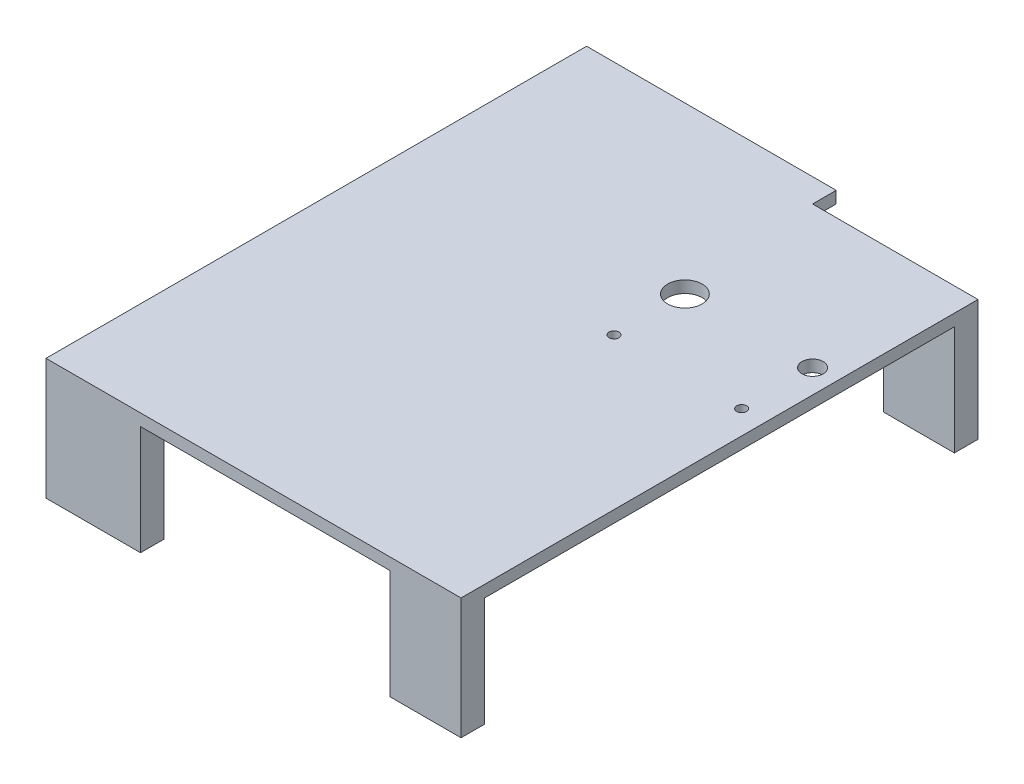
ISO-10303-21;
HEADER;
FILE_DESCRIPTION(('STEP AP214'),'2;1');
FILE_NAME('part.step','',(''),(''),'','','');
FILE_SCHEMA(('AUTOMOTIVE_DESIGN { 1 0 10303 214 1 1 1 1 }'));
ENDSEC;
DATA;
#1=APPLICATION_CONTEXT('core data for automotive mechanical design processes');
#2=APPLICATION_PROTOCOL_DEFINITION('international standard','automotive_design',2000,#1);
#3=PRODUCT_CONTEXT('',#1,'mechanical');
#4=PRODUCT('Part','Part','',(#3));
#5=PRODUCT_RELATED_PRODUCT_CATEGORY('part','',(#4));
#6=PRODUCT_DEFINITION_FORMATION('','',#4);
#7=PRODUCT_DEFINITION_CONTEXT('part definition',#1,'design');
#8=PRODUCT_DEFINITION('design','',#6,#7);
#9=PRODUCT_DEFINITION_SHAPE('','',#8);
#10=(LENGTH_UNIT() NAMED_UNIT(*) SI_UNIT(.MILLI.,.METRE.));
#11=(NAMED_UNIT(*) PLANE_ANGLE_UNIT() SI_UNIT($,.RADIAN.));
#12=(NAMED_UNIT(*) SI_UNIT($,.STERADIAN.) SOLID_ANGLE_UNIT());
#13=UNCERTAINTY_MEASURE_WITH_UNIT(LENGTH_MEASURE(1.E-05),#10,'distance_accuracy_value','');
#14=(GEOMETRIC_REPRESENTATION_CONTEXT(3) GLOBAL_UNCERTAINTY_ASSIGNED_CONTEXT((#13)) GLOBAL_UNIT_ASSIGNED_CONTEXT((#10,
#11,#12)) REPRESENTATION_CONTEXT('',''));
#15=CARTESIAN_POINT('',(0.,0.,0.));
#16=DIRECTION('',(0.,0.,1.));
#17=DIRECTION('',(1.,0.,0.));
#18=AXIS2_PLACEMENT_3D('',#15,#16,#17);
#19=CARTESIAN_POINT('',(12.7,0.,0.));
#20=DIRECTION('',(1.,0.,0.));
#21=DIRECTION('',(0.,0.,-1.));
#22=AXIS2_PLACEMENT_3D('',#19,#20,#21);
#23=PLANE('',#22);
#24=DIRECTION('',(0.,0.,-1.));
#25=VECTOR('',#24,1.);
#26=CARTESIAN_POINT('',(12.7,-58.7375,0.));
#27=LINE('',#26,#25);
#28=CARTESIAN_POINT('',(12.7,-58.7375,145.25625));
#29=VERTEX_POINT('',#28);
#30=CARTESIAN_POINT('',(12.7,-58.7375,132.55625));
#31=VERTEX_POINT('',#30);
#32=EDGE_CURVE('E144',#29,#31,#27,.T.);
#33=ORIENTED_EDGE('',*,*,#32,.T.);
#34=DIRECTION('',(0.,1.,0.));
#35=VECTOR('',#34,1.);
#36=CARTESIAN_POINT('',(12.7,-58.7375,132.55625));
#37=LINE('',#36,#35);
#38=CARTESIAN_POINT('',(12.7,0.,132.55625));
#39=VERTEX_POINT('',#38);
#40=EDGE_CURVE('E141',#31,#39,#37,.T.);
#41=ORIENTED_EDGE('',*,*,#40,.T.);
#42=DIRECTION('',(0.,0.,1.));
#43=VECTOR('',#42,1.);
#44=CARTESIAN_POINT('',(12.7,0.,0.));
#45=LINE('',#44,#43);
#46=CARTESIAN_POINT('',(12.7,0.,-119.85625));
#47=VERTEX_POINT('',#46);
#48=EDGE_CURVE('E128',#47,#39,#45,.T.);
#49=ORIENTED_EDGE('',*,*,#48,.F.);
#50=DIRECTION('',(0.,-1.,0.));
#51=VECTOR('',#50,1.);
#52=CARTESIAN_POINT('',(12.7,-58.7375,-119.85625));
#53=LINE('',#52,#51);
#54=CARTESIAN_POINT('',(12.7,-58.7375,-119.85625));
#55=VERTEX_POINT('',#54);
#56=EDGE_CURVE('E147',#47,#55,#53,.T.);
#57=ORIENTED_EDGE('',*,*,#56,.T.);
#58=DIRECTION('',(0.,0.,-1.));
#59=VECTOR('',#58,1.);
#60=CARTESIAN_POINT('',(12.7,-58.7375,0.));
#61=LINE('',#60,#59);
#62=CARTESIAN_POINT('',(12.7,-58.7375,-132.55625));
#63=VERTEX_POINT('',#62);
#64=EDGE_CURVE('E150',#55,#63,#61,.T.);
#65=ORIENTED_EDGE('',*,*,#64,.T.);
#66=DIRECTION('',(0.,1.,0.));
#67=VECTOR('',#66,1.);
#68=CARTESIAN_POINT('',(12.7,-10.16,-132.55625));
#69=LINE('',#68,#67);
#70=CARTESIAN_POINT('',(12.7,6.35,-132.55625));
#71=VERTEX_POINT('',#70);
#72=EDGE_CURVE('E138',#63,#71,#69,.T.);
#73=ORIENTED_EDGE('',*,*,#72,.T.);
#74=DIRECTION('',(0.,0.,1.));
#75=VECTOR('',#74,1.);
#76=CARTESIAN_POINT('',(12.7,6.35,0.));
#77=LINE('',#76,#75);
#78=CARTESIAN_POINT('',(12.7,6.35,145.25625));
#79=VERTEX_POINT('',#78);
#80=EDGE_CURVE('E135',#71,#79,#77,.T.);
#81=ORIENTED_EDGE('',*,*,#80,.T.);
#82=DIRECTION('',(0.,-1.,0.));
#83=VECTOR('',#82,1.);
#84=CARTESIAN_POINT('',(12.7,6.35,145.25625));
#85=LINE('',#84,#83);
#86=EDGE_CURVE('E132',#79,#29,#85,.T.);
#87=ORIENTED_EDGE('',*,*,#86,.T.);
#88=EDGE_LOOP('',(#33,#41,#49,#57,#65,#73,#81,#87));
#89=FACE_BOUND('',#88,.T.);
#90=ADVANCED_FACE('F33',(#89),#23,.T.);
#91=CARTESIAN_POINT('',(0.,0.,0.));
#92=DIRECTION('',(0.,-1.,0.));
#93=DIRECTION('',(0.,0.,-1.));
#94=AXIS2_PLACEMENT_3D('',#91,#92,#93);
#95=PLANE('',#94);
#96=CARTESIAN_POINT('',(-68.61175,0.,-56.35625));
#97=DIRECTION('',(0.,-1.,0.));
#98=DIRECTION('',(0.,0.,-1.));
#99=AXIS2_PLACEMENT_3D('',#96,#97,#98);
#100=CIRCLE('',#99,9.271);
#101=CARTESIAN_POINT('',(-68.61175,0.,-65.62725));
#102=VERTEX_POINT('',#101);
#103=EDGE_CURVE('E337',#102,#102,#100,.T.);
#104=ORIENTED_EDGE('',*,*,#103,.F.);
#105=EDGE_LOOP('',(#104));
#106=FACE_BOUND('',#105,.T.);
#107=CARTESIAN_POINT('',(0.,0.,-56.35625));
#108=DIRECTION('',(0.,-1.,0.));
#109=DIRECTION('',(0.,0.,-1.));
#110=AXIS2_PLACEMENT_3D('',#107,#108,#109);
#111=CIRCLE('',#110,5.71500000000001);
#112=CARTESIAN_POINT('',(0.,0.,-62.07125));
#113=VERTEX_POINT('',#112);
#114=EDGE_CURVE('E520',#113,#113,#111,.T.);
#115=ORIENTED_EDGE('',*,*,#114,.F.);
#116=EDGE_LOOP('',(#115));
#117=FACE_BOUND('',#116,.T.);
#118=CARTESIAN_POINT('',(-68.61175,0.,-18.25625));
#119=DIRECTION('',(0.,-1.,0.));
#120=DIRECTION('',(0.,0.,-1.));
#121=AXIS2_PLACEMENT_3D('',#118,#119,#120);
#122=CIRCLE('',#121,2.667);
#123=CARTESIAN_POINT('',(-68.61175,0.,-20.92325));
#124=VERTEX_POINT('',#123);
#125=EDGE_CURVE('E523',#124,#124,#122,.T.);
#126=ORIENTED_EDGE('',*,*,#125,.F.);
#127=EDGE_LOOP('',(#126));
#128=FACE_BOUND('',#127,.T.);
#129=CARTESIAN_POINT('',(0.,0.,-18.2562500000009));
#130=DIRECTION('',(0.,-1.,0.));
#131=DIRECTION('',(0.,0.,-1.));
#132=AXIS2_PLACEMENT_3D('',#129,#130,#131);
#133=CIRCLE('',#132,2.667);
#134=CARTESIAN_POINT('',(0.,0.,-20.9232500000009));
#135=VERTEX_POINT('',#134);
#136=EDGE_CURVE('E323',#135,#135,#133,.T.);
#137=ORIENTED_EDGE('',*,*,#136,.F.);
#138=EDGE_LOOP('',(#137));
#139=FACE_BOUND('',#138,.T.);
#140=DIRECTION('',(-1.,0.,0.));
#141=VECTOR('',#140,1.);
#142=CARTESIAN_POINT('',(-25.4,0.,-119.85625));
#143=LINE('',#142,#141);
#144=CARTESIAN_POINT('',(-25.4,0.,-119.85625));
#145=VERTEX_POINT('',#144);
#146=EDGE_CURVE('E37',#47,#145,#143,.T.);
#147=ORIENTED_EDGE('',*,*,#146,.F.);
#148=ORIENTED_EDGE('',*,*,#48,.T.);
#149=DIRECTION('',(1.,0.,0.));
#150=VECTOR('',#149,1.);
#151=CARTESIAN_POINT('',(-25.4,0.,132.55625));
#152=LINE('',#151,#150);
#153=CARTESIAN_POINT('',(-25.4,0.,132.55625));
#154=VERTEX_POINT('',#153);
#155=EDGE_CURVE('E181',#154,#39,#152,.T.);
#156=ORIENTED_EDGE('',*,*,#155,.F.);
#157=DIRECTION('',(0.,0.,-1.));
#158=VECTOR('',#157,1.);
#159=CARTESIAN_POINT('',(-25.4,0.,132.55625));
#160=LINE('',#159,#158);
#161=CARTESIAN_POINT('',(-25.4,0.,145.25625));
#162=VERTEX_POINT('',#161);
#163=EDGE_CURVE('E184',#162,#154,#160,.T.);
#164=ORIENTED_EDGE('',*,*,#163,.F.);
#165=DIRECTION('',(1.,0.,0.));
#166=VECTOR('',#165,1.);
#167=CARTESIAN_POINT('',(-210.34375,0.,145.25625));
#168=LINE('',#167,#166);
#169=CARTESIAN_POINT('',(-159.54375,0.,145.25625));
#170=VERTEX_POINT('',#169);
#171=EDGE_CURVE('E161',#170,#162,#168,.T.);
#172=ORIENTED_EDGE('',*,*,#171,.F.);
#173=DIRECTION('',(0.,0.,1.));
#174=VECTOR('',#173,1.);
#175=CARTESIAN_POINT('',(-159.54375,0.,145.25625));
#176=LINE('',#175,#174);
#177=CARTESIAN_POINT('',(-159.54375,0.,132.55625));
#178=VERTEX_POINT('',#177);
#179=EDGE_CURVE('E284',#178,#170,#176,.T.);
#180=ORIENTED_EDGE('',*,*,#179,.F.);
#181=DIRECTION('',(1.,0.,0.));
#182=VECTOR('',#181,1.);
#183=CARTESIAN_POINT('',(-210.34375,0.,132.55625));
#184=LINE('',#183,#182);
#185=CARTESIAN_POINT('',(-210.34375,0.,132.55625));
#186=VERTEX_POINT('',#185);
#187=EDGE_CURVE('E297',#186,#178,#184,.T.);
#188=ORIENTED_EDGE('',*,*,#187,.F.);
#189=DIRECTION('',(0.,0.,1.));
#190=VECTOR('',#189,1.);
#191=CARTESIAN_POINT('',(-210.34375,0.,145.25625));
#192=LINE('',#191,#190);
#193=CARTESIAN_POINT('',(-210.34375,0.,-132.55625));
#194=VERTEX_POINT('',#193);
#195=EDGE_CURVE('E164',#194,#186,#192,.T.);
#196=ORIENTED_EDGE('',*,*,#195,.F.);
#197=DIRECTION('',(-1.,0.,0.));
#198=VECTOR('',#197,1.);
#199=CARTESIAN_POINT('',(-210.34375,0.,-132.55625));
#200=LINE('',#199,#198);
#201=CARTESIAN_POINT('',(-159.54375,0.,-132.55625));
#202=VERTEX_POINT('',#201);
#203=EDGE_CURVE('E113',#202,#194,#200,.T.);
#204=ORIENTED_EDGE('',*,*,#203,.F.);
#205=DIRECTION('',(0.,0.,1.));
#206=VECTOR('',#205,1.);
#207=CARTESIAN_POINT('',(-159.54375,0.,-145.25625));
#208=LINE('',#207,#206);
#209=CARTESIAN_POINT('',(-159.54375,0.,-145.25625));
#210=VERTEX_POINT('',#209);
#211=EDGE_CURVE('E116',#210,#202,#208,.T.);
#212=ORIENTED_EDGE('',*,*,#211,.F.);
#213=DIRECTION('',(-1.,0.,0.));
#214=VECTOR('',#213,1.);
#215=CARTESIAN_POINT('',(-210.34375,0.,-145.25625));
#216=LINE('',#215,#214);
#217=CARTESIAN_POINT('',(-76.2,0.,-145.25625));
#218=VERTEX_POINT('',#217);
#219=EDGE_CURVE('E165',#218,#210,#216,.T.);
#220=ORIENTED_EDGE('',*,*,#219,.F.);
#221=DIRECTION('',(0.,0.,-1.));
#222=VECTOR('',#221,1.);
#223=CARTESIAN_POINT('',(-76.2,0.,0.));
#224=LINE('',#223,#222);
#225=CARTESIAN_POINT('',(-76.2,0.,-132.55625));
#226=VERTEX_POINT('',#225);
#227=EDGE_CURVE('E103',#226,#218,#224,.T.);
#228=ORIENTED_EDGE('',*,*,#227,.F.);
#229=DIRECTION('',(-1.,0.,0.));
#230=VECTOR('',#229,1.);
#231=CARTESIAN_POINT('',(0.,0.,-132.55625));
#232=LINE('',#231,#230);
#233=CARTESIAN_POINT('',(-25.4,0.,-132.55625));
#234=VERTEX_POINT('',#233);
#235=EDGE_CURVE('E131',#234,#226,#232,.T.);
#236=ORIENTED_EDGE('',*,*,#235,.F.);
#237=DIRECTION('',(0.,0.,-1.));
#238=VECTOR('',#237,1.);
#239=CARTESIAN_POINT('',(-25.4,0.,-132.55625));
#240=LINE('',#239,#238);
#241=EDGE_CURVE('E11',#145,#234,#240,.T.);
#242=ORIENTED_EDGE('',*,*,#241,.F.);
#243=EDGE_LOOP('',(#147,#148,#156,#164,#172,#180,#188,#196,#204,#212,#220,#228,#236,#242));
#244=FACE_BOUND('',#243,.T.);
#245=ADVANCED_FACE('F313',(#106,#117,#128,#139,#244),#95,.T.);
#246=CARTESIAN_POINT('',(-210.34375,6.35,145.25625));
#247=DIRECTION('',(0.,0.,-1.));
#248=DIRECTION('',(-1.,0.,0.));
#249=AXIS2_PLACEMENT_3D('',#246,#247,#248);
#250=PLANE('',#249);
#251=ORIENTED_EDGE('',*,*,#86,.F.);
#252=DIRECTION('',(1.,0.,0.));
#253=VECTOR('',#252,1.);
#254=CARTESIAN_POINT('',(-210.34375,6.35,145.25625));
#255=LINE('',#254,#253);
#256=CARTESIAN_POINT('',(-210.34375,6.35,145.25625));
#257=VERTEX_POINT('',#256);
#258=EDGE_CURVE('E155',#257,#79,#255,.T.);
#259=ORIENTED_EDGE('',*,*,#258,.F.);
#260=DIRECTION('',(0.,-1.,0.));
#261=VECTOR('',#260,1.);
#262=CARTESIAN_POINT('',(-210.34375,6.35,145.25625));
#263=LINE('',#262,#261);
#264=CARTESIAN_POINT('',(-210.34375,-58.7375,145.25625));
#265=VERTEX_POINT('',#264);
#266=EDGE_CURVE('E102',#257,#265,#263,.T.);
#267=ORIENTED_EDGE('',*,*,#266,.T.);
#268=DIRECTION('',(-1.,0.,0.));
#269=VECTOR('',#268,1.);
#270=CARTESIAN_POINT('',(-210.34375,-58.7375,145.25625));
#271=LINE('',#270,#269);
#272=CARTESIAN_POINT('',(-159.54375,-58.7375,145.25625));
#273=VERTEX_POINT('',#272);
#274=EDGE_CURVE('E283',#273,#265,#271,.T.);
#275=ORIENTED_EDGE('',*,*,#274,.F.);
#276=DIRECTION('',(0.,1.,0.));
#277=VECTOR('',#276,1.);
#278=CARTESIAN_POINT('',(-159.54375,-58.7375,145.25625));
#279=LINE('',#278,#277);
#280=EDGE_CURVE('E288',#273,#170,#279,.T.);
#281=ORIENTED_EDGE('',*,*,#280,.T.);
#282=ORIENTED_EDGE('',*,*,#171,.T.);
#283=DIRECTION('',(0.,1.,0.));
#284=VECTOR('',#283,1.);
#285=CARTESIAN_POINT('',(-25.4,-58.7375,145.25625));
#286=LINE('',#285,#284);
#287=CARTESIAN_POINT('',(-25.4,-58.7375,145.25625));
#288=VERTEX_POINT('',#287);
#289=EDGE_CURVE('E327',#288,#162,#286,.T.);
#290=ORIENTED_EDGE('',*,*,#289,.F.);
#291=DIRECTION('',(-1.,0.,0.));
#292=VECTOR('',#291,1.);
#293=CARTESIAN_POINT('',(-25.4,-58.7375,145.25625));
#294=LINE('',#293,#292);
#295=EDGE_CURVE('E178',#29,#288,#294,.T.);
#296=ORIENTED_EDGE('',*,*,#295,.F.);
#297=EDGE_LOOP('',(#251,#259,#267,#275,#281,#282,#290,#296));
#298=FACE_BOUND('',#297,.T.);
#299=ADVANCED_FACE('F356',(#298),#250,.F.);
#300=CARTESIAN_POINT('',(0.,6.35,0.));
#301=DIRECTION('',(0.,-1.,0.));
#302=DIRECTION('',(0.,0.,-1.));
#303=AXIS2_PLACEMENT_3D('',#300,#301,#302);
#304=PLANE('',#303);
#305=CARTESIAN_POINT('',(-68.61175,6.35,-56.35625));
#306=DIRECTION('',(0.,1.,0.));
#307=DIRECTION('',(0.,0.,1.));
#308=AXIS2_PLACEMENT_3D('',#305,#306,#307);
#309=CIRCLE('',#308,9.271);
#310=CARTESIAN_POINT('',(-68.61175,6.35,-47.08525));
#311=VERTEX_POINT('',#310);
#312=EDGE_CURVE('E334',#311,#311,#309,.T.);
#313=ORIENTED_EDGE('',*,*,#312,.F.);
#314=EDGE_LOOP('',(#313));
#315=FACE_BOUND('',#314,.T.);
#316=CARTESIAN_POINT('',(0.,6.35,-56.35625));
#317=DIRECTION('',(0.,1.,0.));
#318=DIRECTION('',(0.,0.,1.));
#319=AXIS2_PLACEMENT_3D('',#316,#317,#318);
#320=CIRCLE('',#319,5.71500000000001);
#321=CARTESIAN_POINT('',(0.,6.35,-50.64125));
#322=VERTEX_POINT('',#321);
#323=EDGE_CURVE('E331',#322,#322,#320,.T.);
#324=ORIENTED_EDGE('',*,*,#323,.F.);
#325=EDGE_LOOP('',(#324));
#326=FACE_BOUND('',#325,.T.);
#327=CARTESIAN_POINT('',(-68.61175,6.35,-18.25625));
#328=DIRECTION('',(0.,1.,0.));
#329=DIRECTION('',(0.,0.,1.));
#330=AXIS2_PLACEMENT_3D('',#327,#328,#329);
#331=CIRCLE('',#330,2.667);
#332=CARTESIAN_POINT('',(-68.61175,6.35,-15.58925));
#333=VERTEX_POINT('',#332);
#334=EDGE_CURVE('E328',#333,#333,#331,.T.);
#335=ORIENTED_EDGE('',*,*,#334,.F.);
#336=EDGE_LOOP('',(#335));
#337=FACE_BOUND('',#336,.T.);
#338=CARTESIAN_POINT('',(0.,6.35,-18.2562500000009));
#339=DIRECTION('',(0.,1.,0.));
#340=DIRECTION('',(0.,0.,1.));
#341=AXIS2_PLACEMENT_3D('',#338,#339,#340);
#342=CIRCLE('',#341,2.667);
#343=CARTESIAN_POINT('',(0.,6.35,-15.5892500000009));
#344=VERTEX_POINT('',#343);
#345=EDGE_CURVE('E324',#344,#344,#342,.T.);
#346=ORIENTED_EDGE('',*,*,#345,.F.);
#347=EDGE_LOOP('',(#346));
#348=FACE_BOUND('',#347,.T.);
#349=ORIENTED_EDGE('',*,*,#80,.F.);
#350=DIRECTION('',(1.,0.,0.));
#351=VECTOR('',#350,1.);
#352=CARTESIAN_POINT('',(-76.2,6.35,-132.55625));
#353=LINE('',#352,#351);
#354=CARTESIAN_POINT('',(-76.2,6.35,-132.55625));
#355=VERTEX_POINT('',#354);
#356=EDGE_CURVE('E168',#355,#71,#353,.T.);
#357=ORIENTED_EDGE('',*,*,#356,.F.);
#358=DIRECTION('',(0.,0.,1.));
#359=VECTOR('',#358,1.);
#360=CARTESIAN_POINT('',(-76.2,6.35,-132.55625));
#361=LINE('',#360,#359);
#362=CARTESIAN_POINT('',(-76.2,6.35,-145.25625));
#363=VERTEX_POINT('',#362);
#364=EDGE_CURVE('E171',#363,#355,#361,.T.);
#365=ORIENTED_EDGE('',*,*,#364,.F.);
#366=DIRECTION('',(-1.,0.,0.));
#367=VECTOR('',#366,1.);
#368=CARTESIAN_POINT('',(-210.34375,6.35,-145.25625));
#369=LINE('',#368,#367);
#370=CARTESIAN_POINT('',(-210.34375,6.35,-145.25625));
#371=VERTEX_POINT('',#370);
#372=EDGE_CURVE('E158',#363,#371,#369,.T.);
#373=ORIENTED_EDGE('',*,*,#372,.T.);
#374=DIRECTION('',(0.,0.,1.));
#375=VECTOR('',#374,1.);
#376=CARTESIAN_POINT('',(-210.34375,6.35,145.25625));
#377=LINE('',#376,#375);
#378=EDGE_CURVE('E99',#371,#257,#377,.T.);
#379=ORIENTED_EDGE('',*,*,#378,.T.);
#380=ORIENTED_EDGE('',*,*,#258,.T.);
#381=EDGE_LOOP('',(#349,#357,#365,#373,#379,#380));
#382=FACE_BOUND('',#381,.T.);
#383=ADVANCED_FACE('F375',(#315,#326,#337,#348,#382),#304,.F.);
#384=CARTESIAN_POINT('',(-76.2,-10.16,-132.55625));
#385=DIRECTION('',(0.,0.,1.));
#386=DIRECTION('',(1.,0.,0.));
#387=AXIS2_PLACEMENT_3D('',#384,#385,#386);
#388=PLANE('',#387);
#389=ORIENTED_EDGE('',*,*,#72,.F.);
#390=DIRECTION('',(1.,0.,0.));
#391=VECTOR('',#390,1.);
#392=CARTESIAN_POINT('',(-25.4,-58.7375,-132.55625));
#393=LINE('',#392,#391);
#394=CARTESIAN_POINT('',(-25.4,-58.7375,-132.55625));
#395=VERTEX_POINT('',#394);
#396=EDGE_CURVE('E127',#395,#63,#393,.T.);
#397=ORIENTED_EDGE('',*,*,#396,.F.);
#398=DIRECTION('',(0.,1.,0.));
#399=VECTOR('',#398,1.);
#400=CARTESIAN_POINT('',(-25.4,-58.7375,-132.55625));
#401=LINE('',#400,#399);
#402=EDGE_CURVE('E120',#395,#234,#401,.T.);
#403=ORIENTED_EDGE('',*,*,#402,.T.);
#404=ORIENTED_EDGE('',*,*,#235,.T.);
#405=DIRECTION('',(0.,1.,0.));
#406=VECTOR('',#405,1.);
#407=CARTESIAN_POINT('',(-76.2,-10.16,-132.55625));
#408=LINE('',#407,#406);
#409=EDGE_CURVE('E167',#226,#355,#408,.T.);
#410=ORIENTED_EDGE('',*,*,#409,.T.);
#411=ORIENTED_EDGE('',*,*,#356,.T.);
#412=EDGE_LOOP('',(#389,#397,#403,#404,#410,#411));
#413=FACE_BOUND('',#412,.T.);
#414=ADVANCED_FACE('F194',(#413),#388,.F.);
#415=CARTESIAN_POINT('',(-25.4,-58.7375,132.55625));
#416=DIRECTION('',(0.,0.,1.));
#417=DIRECTION('',(1.,0.,0.));
#418=AXIS2_PLACEMENT_3D('',#415,#416,#417);
#419=PLANE('',#418);
#420=ORIENTED_EDGE('',*,*,#40,.F.);
#421=DIRECTION('',(1.,0.,0.));
#422=VECTOR('',#421,1.);
#423=CARTESIAN_POINT('',(-25.4,-58.7375,132.55625));
#424=LINE('',#423,#422);
#425=CARTESIAN_POINT('',(-25.4,-58.7375,132.55625));
#426=VERTEX_POINT('',#425);
#427=EDGE_CURVE('E173',#426,#31,#424,.T.);
#428=ORIENTED_EDGE('',*,*,#427,.F.);
#429=DIRECTION('',(0.,1.,0.));
#430=VECTOR('',#429,1.);
#431=CARTESIAN_POINT('',(-25.4,-58.7375,132.55625));
#432=LINE('',#431,#430);
#433=EDGE_CURVE('E177',#426,#154,#432,.T.);
#434=ORIENTED_EDGE('',*,*,#433,.T.);
#435=ORIENTED_EDGE('',*,*,#155,.T.);
#436=EDGE_LOOP('',(#420,#428,#434,#435));
#437=FACE_BOUND('',#436,.T.);
#438=ADVANCED_FACE('F345',(#437),#419,.F.);
#439=CARTESIAN_POINT('',(0.,-58.7375,0.));
#440=DIRECTION('',(0.,1.,0.));
#441=DIRECTION('',(0.,0.,1.));
#442=AXIS2_PLACEMENT_3D('',#439,#440,#441);
#443=PLANE('',#442);
#444=ORIENTED_EDGE('',*,*,#32,.F.);
#445=ORIENTED_EDGE('',*,*,#295,.T.);
#446=DIRECTION('',(0.,0.,-1.));
#447=VECTOR('',#446,1.);
#448=CARTESIAN_POINT('',(-25.4,-58.7375,132.55625));
#449=LINE('',#448,#447);
#450=EDGE_CURVE('E176',#288,#426,#449,.T.);
#451=ORIENTED_EDGE('',*,*,#450,.T.);
#452=ORIENTED_EDGE('',*,*,#427,.T.);
#453=EDGE_LOOP('',(#444,#445,#451,#452));
#454=FACE_BOUND('',#453,.T.);
#455=ADVANCED_FACE('F35',(#454),#443,.F.);
#456=CARTESIAN_POINT('',(-25.4,-58.7375,-119.85625));
#457=DIRECTION('',(0.,0.,-1.));
#458=DIRECTION('',(-1.,0.,0.));
#459=AXIS2_PLACEMENT_3D('',#456,#457,#458);
#460=PLANE('',#459);
#461=ORIENTED_EDGE('',*,*,#56,.F.);
#462=ORIENTED_EDGE('',*,*,#146,.T.);
#463=DIRECTION('',(0.,1.,0.));
#464=VECTOR('',#463,1.);
#465=CARTESIAN_POINT('',(-25.4,-58.7375,-119.85625));
#466=LINE('',#465,#464);
#467=CARTESIAN_POINT('',(-25.4,-58.7375,-119.85625));
#468=VERTEX_POINT('',#467);
#469=EDGE_CURVE('E123',#468,#145,#466,.T.);
#470=ORIENTED_EDGE('',*,*,#469,.F.);
#471=DIRECTION('',(-1.,0.,0.));
#472=VECTOR('',#471,1.);
#473=CARTESIAN_POINT('',(-25.4,-58.7375,-119.85625));
#474=LINE('',#473,#472);
#475=EDGE_CURVE('E62',#55,#468,#474,.T.);
#476=ORIENTED_EDGE('',*,*,#475,.F.);
#477=EDGE_LOOP('',(#461,#462,#470,#476));
#478=FACE_BOUND('',#477,.T.);
#479=ADVANCED_FACE('F203',(#478),#460,.F.);
#480=CARTESIAN_POINT('',(0.,-58.7375,0.));
#481=DIRECTION('',(0.,1.,0.));
#482=DIRECTION('',(0.,0.,1.));
#483=AXIS2_PLACEMENT_3D('',#480,#481,#482);
#484=PLANE('',#483);
#485=ORIENTED_EDGE('',*,*,#64,.F.);
#486=ORIENTED_EDGE('',*,*,#475,.T.);
#487=DIRECTION('',(0.,0.,-1.));
#488=VECTOR('',#487,1.);
#489=CARTESIAN_POINT('',(-25.4,-58.7375,-132.55625));
#490=LINE('',#489,#488);
#491=EDGE_CURVE('E125',#468,#395,#490,.T.);
#492=ORIENTED_EDGE('',*,*,#491,.T.);
#493=ORIENTED_EDGE('',*,*,#396,.T.);
#494=EDGE_LOOP('',(#485,#486,#492,#493));
#495=FACE_BOUND('',#494,.T.);
#496=ADVANCED_FACE('F188',(#495),#484,.F.);
#497=CARTESIAN_POINT('',(-210.34375,6.35,-145.25625));
#498=DIRECTION('',(0.,0.,1.));
#499=DIRECTION('',(1.,0.,0.));
#500=AXIS2_PLACEMENT_3D('',#497,#498,#499);
#501=PLANE('',#500);
#502=ORIENTED_EDGE('',*,*,#372,.F.);
#503=DIRECTION('',(0.,1.,0.));
#504=VECTOR('',#503,1.);
#505=CARTESIAN_POINT('',(-76.2,-10.16,-145.25625));
#506=LINE('',#505,#504);
#507=EDGE_CURVE('E172',#218,#363,#506,.T.);
#508=ORIENTED_EDGE('',*,*,#507,.F.);
#509=ORIENTED_EDGE('',*,*,#219,.T.);
#510=DIRECTION('',(0.,1.,0.));
#511=VECTOR('',#510,1.);
#512=CARTESIAN_POINT('',(-159.54375,-58.7375,-145.25625));
#513=LINE('',#512,#511);
#514=CARTESIAN_POINT('',(-159.54375,-58.7375,-145.25625));
#515=VERTEX_POINT('',#514);
#516=EDGE_CURVE('E70',#515,#210,#513,.T.);
#517=ORIENTED_EDGE('',*,*,#516,.F.);
#518=DIRECTION('',(1.,0.,0.));
#519=VECTOR('',#518,1.);
#520=CARTESIAN_POINT('',(-210.34375,-58.7375,-145.25625));
#521=LINE('',#520,#519);
#522=CARTESIAN_POINT('',(-210.34375,-58.7375,-145.25625));
#523=VERTEX_POINT('',#522);
#524=EDGE_CURVE('E86',#523,#515,#521,.T.);
#525=ORIENTED_EDGE('',*,*,#524,.F.);
#526=DIRECTION('',(0.,-1.,0.));
#527=VECTOR('',#526,1.);
#528=CARTESIAN_POINT('',(-210.34375,6.35,-145.25625));
#529=LINE('',#528,#527);
#530=EDGE_CURVE('E92',#371,#523,#529,.T.);
#531=ORIENTED_EDGE('',*,*,#530,.F.);
#532=EDGE_LOOP('',(#502,#508,#509,#517,#525,#531));
#533=FACE_BOUND('',#532,.T.);
#534=ADVANCED_FACE('F105',(#533),#501,.F.);
#535=CARTESIAN_POINT('',(-210.34375,6.35,145.25625));
#536=DIRECTION('',(1.,0.,0.));
#537=DIRECTION('',(0.,0.,-1.));
#538=AXIS2_PLACEMENT_3D('',#535,#536,#537);
#539=PLANE('',#538);
#540=ORIENTED_EDGE('',*,*,#530,.T.);
#541=DIRECTION('',(0.,0.,-1.));
#542=VECTOR('',#541,1.);
#543=CARTESIAN_POINT('',(-210.34375,-58.7375,-145.25625));
#544=LINE('',#543,#542);
#545=CARTESIAN_POINT('',(-210.34375,-58.7375,-132.55625));
#546=VERTEX_POINT('',#545);
#547=EDGE_CURVE('E95',#546,#523,#544,.T.);
#548=ORIENTED_EDGE('',*,*,#547,.F.);
#549=DIRECTION('',(0.,1.,0.));
#550=VECTOR('',#549,1.);
#551=CARTESIAN_POINT('',(-210.34375,-58.7375,-132.55625));
#552=LINE('',#551,#550);
#553=EDGE_CURVE('E305',#546,#194,#552,.T.);
#554=ORIENTED_EDGE('',*,*,#553,.T.);
#555=ORIENTED_EDGE('',*,*,#195,.T.);
#556=DIRECTION('',(0.,1.,0.));
#557=VECTOR('',#556,1.);
#558=CARTESIAN_POINT('',(-210.34375,-58.7375,132.55625));
#559=LINE('',#558,#557);
#560=CARTESIAN_POINT('',(-210.34375,-58.7375,132.55625));
#561=VERTEX_POINT('',#560);
#562=EDGE_CURVE('E270',#561,#186,#559,.T.);
#563=ORIENTED_EDGE('',*,*,#562,.F.);
#564=DIRECTION('',(0.,0.,-1.));
#565=VECTOR('',#564,1.);
#566=CARTESIAN_POINT('',(-210.34375,-58.7375,145.25625));
#567=LINE('',#566,#565);
#568=EDGE_CURVE('E276',#265,#561,#567,.T.);
#569=ORIENTED_EDGE('',*,*,#568,.F.);
#570=ORIENTED_EDGE('',*,*,#266,.F.);
#571=ORIENTED_EDGE('',*,*,#378,.F.);
#572=EDGE_LOOP('',(#540,#548,#554,#555,#563,#569,#570,#571));
#573=FACE_BOUND('',#572,.T.);
#574=ADVANCED_FACE('F93',(#573),#539,.F.);
#575=CARTESIAN_POINT('',(-76.2,-10.16,-132.55625));
#576=DIRECTION('',(-1.,0.,0.));
#577=DIRECTION('',(0.,0.,1.));
#578=AXIS2_PLACEMENT_3D('',#575,#576,#577);
#579=PLANE('',#578);
#580=ORIENTED_EDGE('',*,*,#227,.T.);
#581=ORIENTED_EDGE('',*,*,#507,.T.);
#582=ORIENTED_EDGE('',*,*,#364,.T.);
#583=ORIENTED_EDGE('',*,*,#409,.F.);
#584=EDGE_LOOP('',(#580,#581,#582,#583));
#585=FACE_BOUND('',#584,.T.);
#586=ADVANCED_FACE('F414',(#585),#579,.F.);
#587=CARTESIAN_POINT('',(-68.61175,-10.16,-56.35625));
#588=DIRECTION('',(0.,1.,0.));
#589=DIRECTION('',(0.,0.,1.));
#590=AXIS2_PLACEMENT_3D('',#587,#588,#589);
#591=CYLINDRICAL_SURFACE('',#590,9.271);
#592=ORIENTED_EDGE('',*,*,#103,.T.);
#593=EDGE_LOOP('',(#592));
#594=FACE_BOUND('',#593,.T.);
#595=ORIENTED_EDGE('',*,*,#312,.T.);
#596=EDGE_LOOP('',(#595));
#597=FACE_BOUND('',#596,.T.);
#598=ADVANCED_FACE('F421',(#594,#597),#591,.F.);
#599=CARTESIAN_POINT('',(0.,-10.16,-56.35625));
#600=DIRECTION('',(0.,1.,0.));
#601=DIRECTION('',(0.,0.,1.));
#602=AXIS2_PLACEMENT_3D('',#599,#600,#601);
#603=CYLINDRICAL_SURFACE('',#602,5.71500000000001);
#604=ORIENTED_EDGE('',*,*,#114,.T.);
#605=EDGE_LOOP('',(#604));
#606=FACE_BOUND('',#605,.T.);
#607=ORIENTED_EDGE('',*,*,#323,.T.);
#608=EDGE_LOOP('',(#607));
#609=FACE_BOUND('',#608,.T.);
#610=ADVANCED_FACE('F429',(#606,#609),#603,.F.);
#611=CARTESIAN_POINT('',(-68.61175,-10.16,-18.25625));
#612=DIRECTION('',(0.,1.,0.));
#613=DIRECTION('',(0.,0.,1.));
#614=AXIS2_PLACEMENT_3D('',#611,#612,#613);
#615=CYLINDRICAL_SURFACE('',#614,2.667);
#616=ORIENTED_EDGE('',*,*,#125,.T.);
#617=EDGE_LOOP('',(#616));
#618=FACE_BOUND('',#617,.T.);
#619=ORIENTED_EDGE('',*,*,#334,.T.);
#620=EDGE_LOOP('',(#619));
#621=FACE_BOUND('',#620,.T.);
#622=ADVANCED_FACE('F437',(#618,#621),#615,.F.);
#623=CARTESIAN_POINT('',(0.,-10.16,-18.2562500000009));
#624=DIRECTION('',(0.,1.,0.));
#625=DIRECTION('',(0.,0.,1.));
#626=AXIS2_PLACEMENT_3D('',#623,#624,#625);
#627=CYLINDRICAL_SURFACE('',#626,2.667);
#628=ORIENTED_EDGE('',*,*,#136,.T.);
#629=EDGE_LOOP('',(#628));
#630=FACE_BOUND('',#629,.T.);
#631=ORIENTED_EDGE('',*,*,#345,.T.);
#632=EDGE_LOOP('',(#631));
#633=FACE_BOUND('',#632,.T.);
#634=ADVANCED_FACE('F445',(#630,#633),#627,.F.);
#635=CARTESIAN_POINT('',(-25.4,-58.7375,132.55625));
#636=DIRECTION('',(1.,0.,0.));
#637=DIRECTION('',(0.,0.,-1.));
#638=AXIS2_PLACEMENT_3D('',#635,#636,#637);
#639=PLANE('',#638);
#640=ORIENTED_EDGE('',*,*,#163,.T.);
#641=ORIENTED_EDGE('',*,*,#433,.F.);
#642=ORIENTED_EDGE('',*,*,#450,.F.);
#643=ORIENTED_EDGE('',*,*,#289,.T.);
#644=EDGE_LOOP('',(#640,#641,#642,#643));
#645=FACE_BOUND('',#644,.T.);
#646=ADVANCED_FACE('F348',(#645),#639,.F.);
#647=CARTESIAN_POINT('',(-210.34375,-58.7375,132.55625));
#648=DIRECTION('',(0.,0.,1.));
#649=DIRECTION('',(1.,0.,0.));
#650=AXIS2_PLACEMENT_3D('',#647,#648,#649);
#651=PLANE('',#650);
#652=ORIENTED_EDGE('',*,*,#187,.T.);
#653=DIRECTION('',(0.,1.,0.));
#654=VECTOR('',#653,1.);
#655=CARTESIAN_POINT('',(-159.54375,-58.7375,132.55625));
#656=LINE('',#655,#654);
#657=CARTESIAN_POINT('',(-159.54375,-58.7375,132.55625));
#658=VERTEX_POINT('',#657);
#659=EDGE_CURVE('E273',#658,#178,#656,.T.);
#660=ORIENTED_EDGE('',*,*,#659,.F.);
#661=DIRECTION('',(1.,0.,0.));
#662=VECTOR('',#661,1.);
#663=CARTESIAN_POINT('',(-210.34375,-58.7375,132.55625));
#664=LINE('',#663,#662);
#665=EDGE_CURVE('E266',#561,#658,#664,.T.);
#666=ORIENTED_EDGE('',*,*,#665,.F.);
#667=ORIENTED_EDGE('',*,*,#562,.T.);
#668=EDGE_LOOP('',(#652,#660,#666,#667));
#669=FACE_BOUND('',#668,.T.);
#670=ADVANCED_FACE('F268',(#669),#651,.F.);
#671=CARTESIAN_POINT('',(-159.54375,-58.7375,145.25625));
#672=DIRECTION('',(-1.,0.,0.));
#673=DIRECTION('',(0.,0.,1.));
#674=AXIS2_PLACEMENT_3D('',#671,#672,#673);
#675=PLANE('',#674);
#676=ORIENTED_EDGE('',*,*,#179,.T.);
#677=ORIENTED_EDGE('',*,*,#280,.F.);
#678=DIRECTION('',(0.,0.,1.));
#679=VECTOR('',#678,1.);
#680=CARTESIAN_POINT('',(-159.54375,-58.7375,145.25625));
#681=LINE('',#680,#679);
#682=EDGE_CURVE('E277',#658,#273,#681,.T.);
#683=ORIENTED_EDGE('',*,*,#682,.F.);
#684=ORIENTED_EDGE('',*,*,#659,.T.);
#685=EDGE_LOOP('',(#676,#677,#683,#684));
#686=FACE_BOUND('',#685,.T.);
#687=ADVANCED_FACE('F359',(#686),#675,.F.);
#688=CARTESIAN_POINT('',(0.,-58.7375,0.));
#689=DIRECTION('',(0.,-1.,0.));
#690=DIRECTION('',(0.,0.,-1.));
#691=AXIS2_PLACEMENT_3D('',#688,#689,#690);
#692=PLANE('',#691);
#693=ORIENTED_EDGE('',*,*,#568,.T.);
#694=ORIENTED_EDGE('',*,*,#665,.T.);
#695=ORIENTED_EDGE('',*,*,#682,.T.);
#696=ORIENTED_EDGE('',*,*,#274,.T.);
#697=EDGE_LOOP('',(#693,#694,#695,#696));
#698=FACE_BOUND('',#697,.T.);
#699=ADVANCED_FACE('F281',(#698),#692,.T.);
#700=CARTESIAN_POINT('',(-159.54375,-58.7375,-145.25625));
#701=DIRECTION('',(-1.,0.,0.));
#702=DIRECTION('',(0.,0.,1.));
#703=AXIS2_PLACEMENT_3D('',#700,#701,#702);
#704=PLANE('',#703);
#705=ORIENTED_EDGE('',*,*,#211,.T.);
#706=DIRECTION('',(0.,1.,0.));
#707=VECTOR('',#706,1.);
#708=CARTESIAN_POINT('',(-159.54375,-58.7375,-132.55625));
#709=LINE('',#708,#707);
#710=CARTESIAN_POINT('',(-159.54375,-58.7375,-132.55625));
#711=VERTEX_POINT('',#710);
#712=EDGE_CURVE('E302',#711,#202,#709,.T.);
#713=ORIENTED_EDGE('',*,*,#712,.F.);
#714=DIRECTION('',(0.,0.,1.));
#715=VECTOR('',#714,1.);
#716=CARTESIAN_POINT('',(-159.54375,-58.7375,-145.25625));
#717=LINE('',#716,#715);
#718=EDGE_CURVE('E107',#515,#711,#717,.T.);
#719=ORIENTED_EDGE('',*,*,#718,.F.);
#720=ORIENTED_EDGE('',*,*,#516,.T.);
#721=EDGE_LOOP('',(#705,#713,#719,#720));
#722=FACE_BOUND('',#721,.T.);
#723=ADVANCED_FACE('F309',(#722),#704,.F.);
#724=CARTESIAN_POINT('',(-210.34375,-58.7375,-132.55625));
#725=DIRECTION('',(0.,0.,-1.));
#726=DIRECTION('',(-1.,0.,0.));
#727=AXIS2_PLACEMENT_3D('',#724,#725,#726);
#728=PLANE('',#727);
#729=ORIENTED_EDGE('',*,*,#203,.T.);
#730=ORIENTED_EDGE('',*,*,#553,.F.);
#731=DIRECTION('',(-1.,0.,0.));
#732=VECTOR('',#731,1.);
#733=CARTESIAN_POINT('',(-210.34375,-58.7375,-132.55625));
#734=LINE('',#733,#732);
#735=EDGE_CURVE('E111',#711,#546,#734,.T.);
#736=ORIENTED_EDGE('',*,*,#735,.F.);
#737=ORIENTED_EDGE('',*,*,#712,.T.);
#738=EDGE_LOOP('',(#729,#730,#736,#737));
#739=FACE_BOUND('',#738,.T.);
#740=ADVANCED_FACE('F312',(#739),#728,.F.);
#741=CARTESIAN_POINT('',(0.,-58.7375,0.));
#742=DIRECTION('',(0.,1.,0.));
#743=DIRECTION('',(0.,0.,1.));
#744=AXIS2_PLACEMENT_3D('',#741,#742,#743);
#745=PLANE('',#744);
#746=ORIENTED_EDGE('',*,*,#547,.T.);
#747=ORIENTED_EDGE('',*,*,#524,.T.);
#748=ORIENTED_EDGE('',*,*,#718,.T.);
#749=ORIENTED_EDGE('',*,*,#735,.T.);
#750=EDGE_LOOP('',(#746,#747,#748,#749));
#751=FACE_BOUND('',#750,.T.);
#752=ADVANCED_FACE('F109',(#751),#745,.F.);
#753=CARTESIAN_POINT('',(-25.4,-58.7375,-132.55625));
#754=DIRECTION('',(1.,0.,0.));
#755=DIRECTION('',(0.,0.,-1.));
#756=AXIS2_PLACEMENT_3D('',#753,#754,#755);
#757=PLANE('',#756);
#758=ORIENTED_EDGE('',*,*,#241,.T.);
#759=ORIENTED_EDGE('',*,*,#402,.F.);
#760=ORIENTED_EDGE('',*,*,#491,.F.);
#761=ORIENTED_EDGE('',*,*,#469,.T.);
#762=EDGE_LOOP('',(#758,#759,#760,#761));
#763=FACE_BOUND('',#762,.T.);
#764=ADVANCED_FACE('F377',(#763),#757,.F.);
#765=CLOSED_SHELL('',(#90,#245,#299,#383,#414,#438,#455,#479,#496,#534,#574,#586,#598,#610,#622,
#634,#646,#670,#687,#699,#723,#740,#752,#764));
#766=MANIFOLD_SOLID_BREP('B2',#765);
#767=ADVANCED_BREP_SHAPE_REPRESENTATION('',(#18,#766),#14);
#768=SHAPE_DEFINITION_REPRESENTATION(#9,#767);
ENDSEC;
END-ISO-10303-21;
